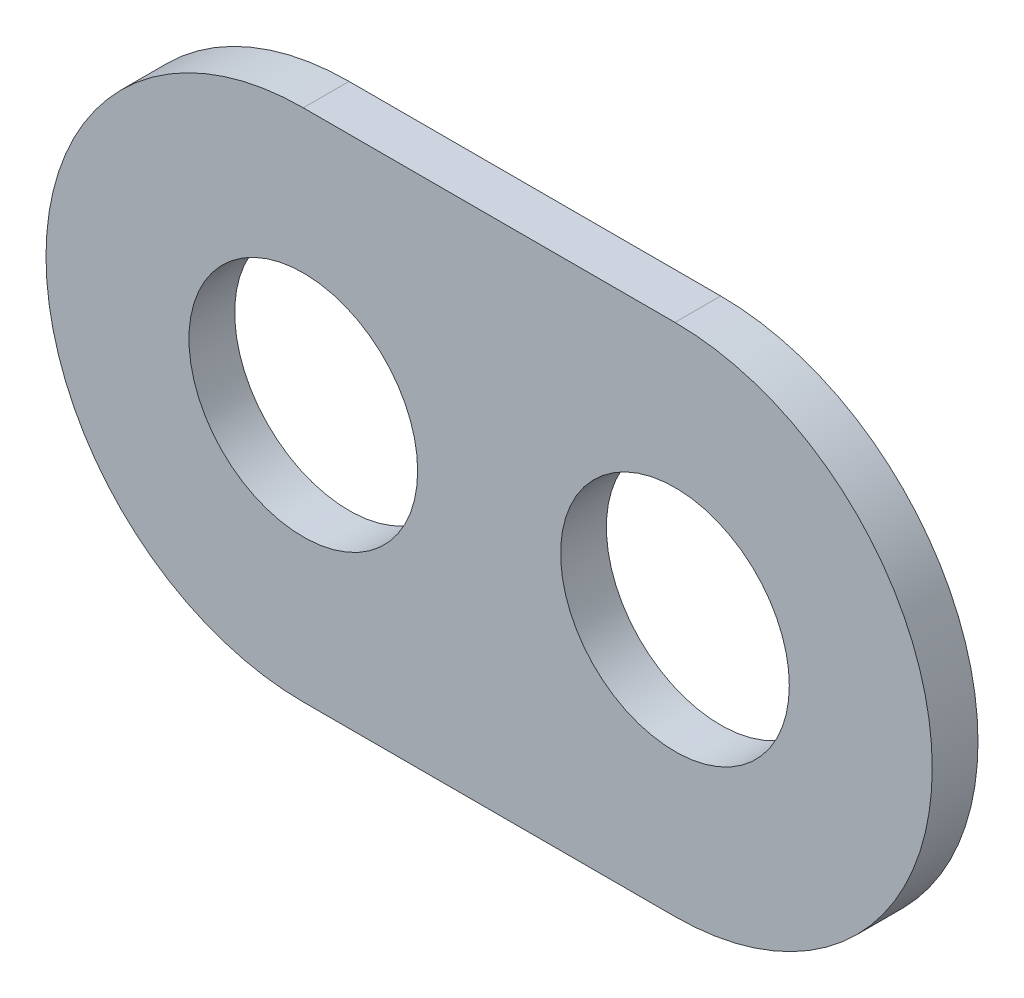
ISO-10303-21;
HEADER;
FILE_DESCRIPTION(('STEP AP214'),'2;1');
FILE_NAME('part.step','',(''),(''),'','','');
FILE_SCHEMA(('AUTOMOTIVE_DESIGN { 1 0 10303 214 1 1 1 1 }'));
ENDSEC;
DATA;
#1=APPLICATION_CONTEXT('core data for automotive mechanical design processes');
#2=APPLICATION_PROTOCOL_DEFINITION('international standard','automotive_design',2000,#1);
#3=PRODUCT_CONTEXT('',#1,'mechanical');
#4=PRODUCT('Part','Part','',(#3));
#5=PRODUCT_RELATED_PRODUCT_CATEGORY('part','',(#4));
#6=PRODUCT_DEFINITION_FORMATION('','',#4);
#7=PRODUCT_DEFINITION_CONTEXT('part definition',#1,'design');
#8=PRODUCT_DEFINITION('design','',#6,#7);
#9=PRODUCT_DEFINITION_SHAPE('','',#8);
#10=(LENGTH_UNIT() NAMED_UNIT(*) SI_UNIT(.MILLI.,.METRE.));
#11=(NAMED_UNIT(*) PLANE_ANGLE_UNIT() SI_UNIT($,.RADIAN.));
#12=(NAMED_UNIT(*) SI_UNIT($,.STERADIAN.) SOLID_ANGLE_UNIT());
#13=UNCERTAINTY_MEASURE_WITH_UNIT(LENGTH_MEASURE(1.E-05),#10,'distance_accuracy_value','');
#14=(GEOMETRIC_REPRESENTATION_CONTEXT(3) GLOBAL_UNCERTAINTY_ASSIGNED_CONTEXT((#13)) GLOBAL_UNIT_ASSIGNED_CONTEXT((#10,
#11,#12)) REPRESENTATION_CONTEXT('',''));
#15=CARTESIAN_POINT('',(0.,0.,0.));
#16=DIRECTION('',(0.,0.,1.));
#17=DIRECTION('',(1.,0.,0.));
#18=AXIS2_PLACEMENT_3D('',#15,#16,#17);
#19=CARTESIAN_POINT('',(-13.,0.,3.2));
#20=DIRECTION('',(0.,0.,1.));
#21=DIRECTION('',(1.,0.,0.));
#22=AXIS2_PLACEMENT_3D('',#19,#20,#21);
#23=PLANE('',#22);
#24=CARTESIAN_POINT('',(-13.,0.,3.2));
#25=DIRECTION('',(0.,0.,1.));
#26=DIRECTION('',(1.,0.,0.));
#27=AXIS2_PLACEMENT_3D('',#24,#25,#26);
#28=CIRCLE('',#27,8.);
#29=CARTESIAN_POINT('',(-5.,0.,3.2));
#30=VERTEX_POINT('',#29);
#31=EDGE_CURVE('E99',#30,#30,#28,.T.);
#32=ORIENTED_EDGE('',*,*,#31,.F.);
#33=EDGE_LOOP('',(#32));
#34=FACE_BOUND('',#33,.T.);
#35=CARTESIAN_POINT('',(-13.,0.,3.2));
#36=DIRECTION('',(0.,0.,1.));
#37=DIRECTION('',(1.,0.,0.));
#38=AXIS2_PLACEMENT_3D('',#35,#36,#37);
#39=CIRCLE('',#38,18.);
#40=CARTESIAN_POINT('',(-13.,18.,3.2));
#41=VERTEX_POINT('',#40);
#42=CARTESIAN_POINT('',(-13.,-18.,3.2));
#43=VERTEX_POINT('',#42);
#44=EDGE_CURVE('E84',#41,#43,#39,.T.);
#45=ORIENTED_EDGE('',*,*,#44,.T.);
#46=DIRECTION('',(1.,0.,0.));
#47=VECTOR('',#46,1.);
#48=CARTESIAN_POINT('',(-13.,-18.,3.2));
#49=LINE('',#48,#47);
#50=CARTESIAN_POINT('',(13.,-18.,3.2));
#51=VERTEX_POINT('',#50);
#52=EDGE_CURVE('E79',#43,#51,#49,.T.);
#53=ORIENTED_EDGE('',*,*,#52,.T.);
#54=CARTESIAN_POINT('',(13.,0.,3.2));
#55=DIRECTION('',(0.,0.,1.));
#56=DIRECTION('',(1.,0.,0.));
#57=AXIS2_PLACEMENT_3D('',#54,#55,#56);
#58=CIRCLE('',#57,18.);
#59=CARTESIAN_POINT('',(13.,18.,3.2));
#60=VERTEX_POINT('',#59);
#61=EDGE_CURVE('E82',#51,#60,#58,.T.);
#62=ORIENTED_EDGE('',*,*,#61,.T.);
#63=DIRECTION('',(-1.,0.,0.));
#64=VECTOR('',#63,1.);
#65=CARTESIAN_POINT('',(-13.,18.,3.2));
#66=LINE('',#65,#64);
#67=EDGE_CURVE('E49',#60,#41,#66,.T.);
#68=ORIENTED_EDGE('',*,*,#67,.T.);
#69=EDGE_LOOP('',(#45,#53,#62,#68));
#70=FACE_BOUND('',#69,.T.);
#71=CARTESIAN_POINT('',(13.,0.,3.2));
#72=DIRECTION('',(0.,0.,1.));
#73=DIRECTION('',(1.,0.,0.));
#74=AXIS2_PLACEMENT_3D('',#71,#72,#73);
#75=CIRCLE('',#74,8.);
#76=CARTESIAN_POINT('',(21.,0.,3.2));
#77=VERTEX_POINT('',#76);
#78=EDGE_CURVE('E114',#77,#77,#75,.T.);
#79=ORIENTED_EDGE('',*,*,#78,.F.);
#80=EDGE_LOOP('',(#79));
#81=FACE_BOUND('',#80,.T.);
#82=ADVANCED_FACE('F32',(#34,#70,#81),#23,.T.);
#83=CARTESIAN_POINT('',(-13.,0.,0.));
#84=DIRECTION('',(0.,0.,1.));
#85=DIRECTION('',(1.,0.,0.));
#86=AXIS2_PLACEMENT_3D('',#83,#84,#85);
#87=PLANE('',#86);
#88=CARTESIAN_POINT('',(-13.,0.,0.));
#89=DIRECTION('',(0.,0.,1.));
#90=DIRECTION('',(1.,0.,0.));
#91=AXIS2_PLACEMENT_3D('',#88,#89,#90);
#92=CIRCLE('',#91,18.);
#93=CARTESIAN_POINT('',(-13.,18.,0.));
#94=VERTEX_POINT('',#93);
#95=CARTESIAN_POINT('',(-13.,-18.,0.));
#96=VERTEX_POINT('',#95);
#97=EDGE_CURVE('E96',#94,#96,#92,.T.);
#98=ORIENTED_EDGE('',*,*,#97,.F.);
#99=DIRECTION('',(-1.,0.,0.));
#100=VECTOR('',#99,1.);
#101=CARTESIAN_POINT('',(-13.,18.,0.));
#102=LINE('',#101,#100);
#103=CARTESIAN_POINT('',(13.,18.,0.));
#104=VERTEX_POINT('',#103);
#105=EDGE_CURVE('E72',#104,#94,#102,.T.);
#106=ORIENTED_EDGE('',*,*,#105,.F.);
#107=CARTESIAN_POINT('',(13.,0.,0.));
#108=DIRECTION('',(0.,0.,1.));
#109=DIRECTION('',(1.,0.,0.));
#110=AXIS2_PLACEMENT_3D('',#107,#108,#109);
#111=CIRCLE('',#110,18.);
#112=CARTESIAN_POINT('',(13.,-18.,0.));
#113=VERTEX_POINT('',#112);
#114=EDGE_CURVE('E66',#113,#104,#111,.T.);
#115=ORIENTED_EDGE('',*,*,#114,.F.);
#116=DIRECTION('',(1.,0.,0.));
#117=VECTOR('',#116,1.);
#118=CARTESIAN_POINT('',(-13.,-18.,0.));
#119=LINE('',#118,#117);
#120=EDGE_CURVE('E88',#96,#113,#119,.T.);
#121=ORIENTED_EDGE('',*,*,#120,.F.);
#122=EDGE_LOOP('',(#98,#106,#115,#121));
#123=FACE_BOUND('',#122,.T.);
#124=CARTESIAN_POINT('',(-13.,0.,0.));
#125=DIRECTION('',(0.,0.,1.));
#126=DIRECTION('',(1.,0.,0.));
#127=AXIS2_PLACEMENT_3D('',#124,#125,#126);
#128=CIRCLE('',#127,8.);
#129=CARTESIAN_POINT('',(-5.,0.,0.));
#130=VERTEX_POINT('',#129);
#131=EDGE_CURVE('E111',#130,#130,#128,.T.);
#132=ORIENTED_EDGE('',*,*,#131,.T.);
#133=EDGE_LOOP('',(#132));
#134=FACE_BOUND('',#133,.T.);
#135=CARTESIAN_POINT('',(13.,0.,0.));
#136=DIRECTION('',(0.,0.,1.));
#137=DIRECTION('',(1.,0.,0.));
#138=AXIS2_PLACEMENT_3D('',#135,#136,#137);
#139=CIRCLE('',#138,8.);
#140=CARTESIAN_POINT('',(21.,0.,0.));
#141=VERTEX_POINT('',#140);
#142=EDGE_CURVE('E117',#141,#141,#139,.T.);
#143=ORIENTED_EDGE('',*,*,#142,.T.);
#144=EDGE_LOOP('',(#143));
#145=FACE_BOUND('',#144,.T.);
#146=ADVANCED_FACE('F107',(#123,#134,#145),#87,.F.);
#147=CARTESIAN_POINT('',(-13.,0.,3.2));
#148=DIRECTION('',(0.,0.,-1.));
#149=DIRECTION('',(-1.,0.,0.));
#150=AXIS2_PLACEMENT_3D('',#147,#148,#149);
#151=CYLINDRICAL_SURFACE('',#150,18.);
#152=ORIENTED_EDGE('',*,*,#97,.T.);
#153=DIRECTION('',(0.,0.,-1.));
#154=VECTOR('',#153,1.);
#155=CARTESIAN_POINT('',(-13.,-18.,3.2));
#156=LINE('',#155,#154);
#157=EDGE_CURVE('E11',#43,#96,#156,.T.);
#158=ORIENTED_EDGE('',*,*,#157,.F.);
#159=ORIENTED_EDGE('',*,*,#44,.F.);
#160=DIRECTION('',(0.,0.,-1.));
#161=VECTOR('',#160,1.);
#162=CARTESIAN_POINT('',(-13.,18.,3.2));
#163=LINE('',#162,#161);
#164=EDGE_CURVE('E92',#41,#94,#163,.T.);
#165=ORIENTED_EDGE('',*,*,#164,.T.);
#166=EDGE_LOOP('',(#152,#158,#159,#165));
#167=FACE_BOUND('',#166,.T.);
#168=ADVANCED_FACE('F34',(#167),#151,.T.);
#169=CARTESIAN_POINT('',(-13.,-18.,3.2));
#170=DIRECTION('',(0.,1.,0.));
#171=DIRECTION('',(-1.,0.,0.));
#172=AXIS2_PLACEMENT_3D('',#169,#170,#171);
#173=PLANE('',#172);
#174=ORIENTED_EDGE('',*,*,#120,.T.);
#175=DIRECTION('',(0.,0.,-1.));
#176=VECTOR('',#175,1.);
#177=CARTESIAN_POINT('',(13.,-18.,3.2));
#178=LINE('',#177,#176);
#179=EDGE_CURVE('E41',#51,#113,#178,.T.);
#180=ORIENTED_EDGE('',*,*,#179,.F.);
#181=ORIENTED_EDGE('',*,*,#52,.F.);
#182=ORIENTED_EDGE('',*,*,#157,.T.);
#183=EDGE_LOOP('',(#174,#180,#181,#182));
#184=FACE_BOUND('',#183,.T.);
#185=ADVANCED_FACE('F87',(#184),#173,.F.);
#186=CARTESIAN_POINT('',(13.,0.,3.2));
#187=DIRECTION('',(0.,0.,-1.));
#188=DIRECTION('',(-1.,0.,0.));
#189=AXIS2_PLACEMENT_3D('',#186,#187,#188);
#190=CYLINDRICAL_SURFACE('',#189,18.);
#191=ORIENTED_EDGE('',*,*,#114,.T.);
#192=DIRECTION('',(0.,0.,-1.));
#193=VECTOR('',#192,1.);
#194=CARTESIAN_POINT('',(13.,18.,3.2));
#195=LINE('',#194,#193);
#196=EDGE_CURVE('E89',#60,#104,#195,.T.);
#197=ORIENTED_EDGE('',*,*,#196,.F.);
#198=ORIENTED_EDGE('',*,*,#61,.F.);
#199=ORIENTED_EDGE('',*,*,#179,.T.);
#200=EDGE_LOOP('',(#191,#197,#198,#199));
#201=FACE_BOUND('',#200,.T.);
#202=ADVANCED_FACE('F90',(#201),#190,.T.);
#203=CARTESIAN_POINT('',(-13.,18.,3.2));
#204=DIRECTION('',(0.,-1.,0.));
#205=DIRECTION('',(1.,0.,0.));
#206=AXIS2_PLACEMENT_3D('',#203,#204,#205);
#207=PLANE('',#206);
#208=ORIENTED_EDGE('',*,*,#105,.T.);
#209=ORIENTED_EDGE('',*,*,#164,.F.);
#210=ORIENTED_EDGE('',*,*,#67,.F.);
#211=ORIENTED_EDGE('',*,*,#196,.T.);
#212=EDGE_LOOP('',(#208,#209,#210,#211));
#213=FACE_BOUND('',#212,.T.);
#214=ADVANCED_FACE('F104',(#213),#207,.F.);
#215=CARTESIAN_POINT('',(-13.,0.,3.2));
#216=DIRECTION('',(0.,0.,-1.));
#217=DIRECTION('',(-1.,0.,0.));
#218=AXIS2_PLACEMENT_3D('',#215,#216,#217);
#219=CYLINDRICAL_SURFACE('',#218,8.);
#220=ORIENTED_EDGE('',*,*,#31,.T.);
#221=EDGE_LOOP('',(#220));
#222=FACE_BOUND('',#221,.T.);
#223=ORIENTED_EDGE('',*,*,#131,.F.);
#224=EDGE_LOOP('',(#223));
#225=FACE_BOUND('',#224,.T.);
#226=ADVANCED_FACE('F134',(#222,#225),#219,.F.);
#227=CARTESIAN_POINT('',(13.,0.,3.2));
#228=DIRECTION('',(0.,0.,-1.));
#229=DIRECTION('',(-1.,0.,0.));
#230=AXIS2_PLACEMENT_3D('',#227,#228,#229);
#231=CYLINDRICAL_SURFACE('',#230,8.);
#232=ORIENTED_EDGE('',*,*,#78,.T.);
#233=EDGE_LOOP('',(#232));
#234=FACE_BOUND('',#233,.T.);
#235=ORIENTED_EDGE('',*,*,#142,.F.);
#236=EDGE_LOOP('',(#235));
#237=FACE_BOUND('',#236,.T.);
#238=ADVANCED_FACE('F123',(#234,#237),#231,.F.);
#239=CLOSED_SHELL('',(#82,#146,#168,#185,#202,#214,#226,#238));
#240=MANIFOLD_SOLID_BREP('B2',#239);
#241=ADVANCED_BREP_SHAPE_REPRESENTATION('',(#18,#240),#14);
#242=SHAPE_DEFINITION_REPRESENTATION(#9,#241);
ENDSEC;
END-ISO-10303-21;
